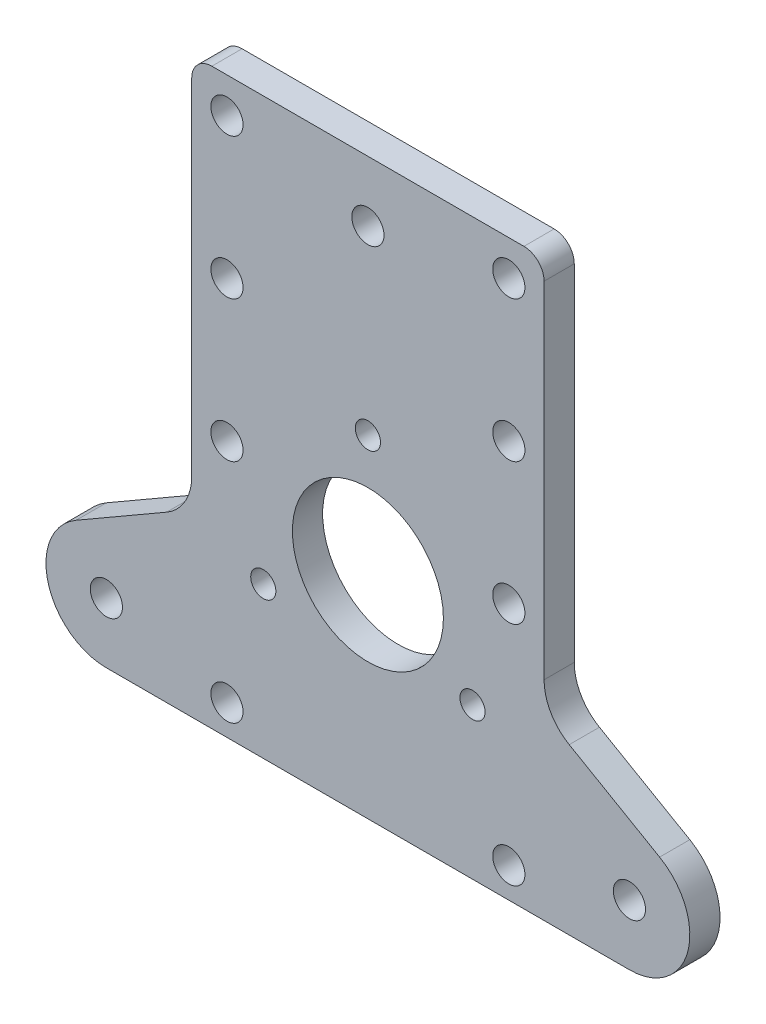
ISO-10303-21;
HEADER;
FILE_DESCRIPTION(('STEP AP214'),'2;1');
FILE_NAME('part.step','',(''),(''),'','','');
FILE_SCHEMA(('AUTOMOTIVE_DESIGN { 1 0 10303 214 1 1 1 1 }'));
ENDSEC;
DATA;
#1=APPLICATION_CONTEXT('core data for automotive mechanical design processes');
#2=APPLICATION_PROTOCOL_DEFINITION('international standard','automotive_design',2000,#1);
#3=PRODUCT_CONTEXT('',#1,'mechanical');
#4=PRODUCT('Part','Part','',(#3));
#5=PRODUCT_RELATED_PRODUCT_CATEGORY('part','',(#4));
#6=PRODUCT_DEFINITION_FORMATION('','',#4);
#7=PRODUCT_DEFINITION_CONTEXT('part definition',#1,'design');
#8=PRODUCT_DEFINITION('design','',#6,#7);
#9=PRODUCT_DEFINITION_SHAPE('','',#8);
#10=(LENGTH_UNIT() NAMED_UNIT(*) SI_UNIT(.MILLI.,.METRE.));
#11=(NAMED_UNIT(*) PLANE_ANGLE_UNIT() SI_UNIT($,.RADIAN.));
#12=(NAMED_UNIT(*) SI_UNIT($,.STERADIAN.) SOLID_ANGLE_UNIT());
#13=UNCERTAINTY_MEASURE_WITH_UNIT(LENGTH_MEASURE(1.E-05),#10,'distance_accuracy_value','');
#14=(GEOMETRIC_REPRESENTATION_CONTEXT(3) GLOBAL_UNCERTAINTY_ASSIGNED_CONTEXT((#13)) GLOBAL_UNIT_ASSIGNED_CONTEXT((#10,
#11,#12)) REPRESENTATION_CONTEXT('',''));
#15=CARTESIAN_POINT('',(0.,0.,0.));
#16=DIRECTION('',(0.,0.,1.));
#17=DIRECTION('',(1.,0.,0.));
#18=AXIS2_PLACEMENT_3D('',#15,#16,#17);
#19=CARTESIAN_POINT('',(25.9807621135331,-15.0000000000001,3.));
#20=DIRECTION('',(0.,0.,-1.));
#21=DIRECTION('',(-1.,0.,0.));
#22=AXIS2_PLACEMENT_3D('',#19,#20,#21);
#23=CYLINDRICAL_SURFACE('',#22,6.);
#24=CARTESIAN_POINT('',(25.9807621135331,-15.0000000000001,0.));
#25=DIRECTION('',(0.,0.,1.));
#26=DIRECTION('',(1.,0.,0.));
#27=AXIS2_PLACEMENT_3D('',#24,#25,#26);
#28=CIRCLE('',#27,6.);
#29=CARTESIAN_POINT('',(25.9807621135331,-21.0000000000001,0.));
#30=VERTEX_POINT('',#29);
#31=CARTESIAN_POINT('',(28.9807621135331,-9.80384757729348,0.));
#32=VERTEX_POINT('',#31);
#33=EDGE_CURVE('E167',#30,#32,#28,.T.);
#34=ORIENTED_EDGE('',*,*,#33,.T.);
#35=DIRECTION('',(0.,0.,-1.));
#36=VECTOR('',#35,1.);
#37=CARTESIAN_POINT('',(28.9807621135331,-9.80384757729348,3.));
#38=LINE('',#37,#36);
#39=CARTESIAN_POINT('',(28.9807621135331,-9.80384757729348,3.));
#40=VERTEX_POINT('',#39);
#41=EDGE_CURVE('E146',#40,#32,#38,.T.);
#42=ORIENTED_EDGE('',*,*,#41,.F.);
#43=CARTESIAN_POINT('',(25.9807621135331,-15.0000000000001,3.));
#44=DIRECTION('',(0.,0.,1.));
#45=DIRECTION('',(1.,0.,0.));
#46=AXIS2_PLACEMENT_3D('',#43,#44,#45);
#47=CIRCLE('',#46,6.);
#48=CARTESIAN_POINT('',(25.9807621135331,-21.0000000000001,3.));
#49=VERTEX_POINT('',#48);
#50=EDGE_CURVE('E154',#49,#40,#47,.T.);
#51=ORIENTED_EDGE('',*,*,#50,.F.);
#52=DIRECTION('',(0.,0.,-1.));
#53=VECTOR('',#52,1.);
#54=CARTESIAN_POINT('',(25.9807621135331,-21.0000000000001,3.));
#55=LINE('',#54,#53);
#56=EDGE_CURVE('E305',#49,#30,#55,.T.);
#57=ORIENTED_EDGE('',*,*,#56,.T.);
#58=EDGE_LOOP('',(#34,#42,#51,#57));
#59=FACE_BOUND('',#58,.T.);
#60=ADVANCED_FACE('F47',(#59),#23,.T.);
#61=CARTESIAN_POINT('',(28.9807621135331,-9.80384757729348,3.));
#62=DIRECTION('',(-0.5,-0.866025403784439,0.));
#63=DIRECTION('',(0.866025403784439,-0.5,0.));
#64=AXIS2_PLACEMENT_3D('',#61,#62,#63);
#65=PLANE('',#64);
#66=DIRECTION('',(-0.866025403784439,0.5,0.));
#67=VECTOR('',#66,1.);
#68=CARTESIAN_POINT('',(28.9807621135331,-9.80384757729348,0.));
#69=LINE('',#68,#67);
#70=CARTESIAN_POINT('',(20.,-4.61880215351718,0.));
#71=VERTEX_POINT('',#70);
#72=EDGE_CURVE('E316',#32,#71,#69,.T.);
#73=ORIENTED_EDGE('',*,*,#72,.T.);
#74=DIRECTION('',(0.,0.,-1.));
#75=VECTOR('',#74,1.);
#76=CARTESIAN_POINT('',(20.,-4.61880215351718,3.));
#77=LINE('',#76,#75);
#78=CARTESIAN_POINT('',(20.,-4.61880215351718,3.));
#79=VERTEX_POINT('',#78);
#80=EDGE_CURVE('E149',#71,#79,#77,.F.);
#81=ORIENTED_EDGE('',*,*,#80,.T.);
#82=DIRECTION('',(-0.866025403784439,0.5,0.));
#83=VECTOR('',#82,1.);
#84=CARTESIAN_POINT('',(28.9807621135331,-9.80384757729348,3.));
#85=LINE('',#84,#83);
#86=EDGE_CURVE('E141',#40,#79,#85,.T.);
#87=ORIENTED_EDGE('',*,*,#86,.F.);
#88=ORIENTED_EDGE('',*,*,#41,.T.);
#89=EDGE_LOOP('',(#73,#81,#87,#88));
#90=FACE_BOUND('',#89,.T.);
#91=ADVANCED_FACE('F144',(#90),#65,.F.);
#92=CARTESIAN_POINT('',(17.5,36.,3.));
#93=DIRECTION('',(-1.,0.,0.));
#94=DIRECTION('',(0.,-1.,0.));
#95=AXIS2_PLACEMENT_3D('',#92,#93,#94);
#96=PLANE('',#95);
#97=DIRECTION('',(0.,1.,0.));
#98=VECTOR('',#97,1.);
#99=CARTESIAN_POINT('',(17.5,36.,0.));
#100=LINE('',#99,#98);
#101=CARTESIAN_POINT('',(17.5,-0.28867513459499,0.));
#102=VERTEX_POINT('',#101);
#103=CARTESIAN_POINT('',(17.5,34.,0.));
#104=VERTEX_POINT('',#103);
#105=EDGE_CURVE('E297',#102,#104,#100,.T.);
#106=ORIENTED_EDGE('',*,*,#105,.T.);
#107=DIRECTION('',(0.,0.,-1.));
#108=VECTOR('',#107,1.);
#109=CARTESIAN_POINT('',(17.5,34.,3.));
#110=LINE('',#109,#108);
#111=CARTESIAN_POINT('',(17.5,34.,3.));
#112=VERTEX_POINT('',#111);
#113=EDGE_CURVE('E12',#104,#112,#110,.F.);
#114=ORIENTED_EDGE('',*,*,#113,.T.);
#115=DIRECTION('',(0.,1.,0.));
#116=VECTOR('',#115,1.);
#117=CARTESIAN_POINT('',(17.5,36.,3.));
#118=LINE('',#117,#116);
#119=CARTESIAN_POINT('',(17.5,-0.28867513459499,3.));
#120=VERTEX_POINT('',#119);
#121=EDGE_CURVE('E153',#120,#112,#118,.T.);
#122=ORIENTED_EDGE('',*,*,#121,.F.);
#123=DIRECTION('',(0.,0.,-1.));
#124=VECTOR('',#123,1.);
#125=CARTESIAN_POINT('',(17.5,-0.28867513459499,0.));
#126=LINE('',#125,#124);
#127=EDGE_CURVE('E169',#120,#102,#126,.T.);
#128=ORIENTED_EDGE('',*,*,#127,.T.);
#129=EDGE_LOOP('',(#106,#114,#122,#128));
#130=FACE_BOUND('',#129,.T.);
#131=ADVANCED_FACE('F324',(#130),#96,.F.);
#132=CARTESIAN_POINT('',(17.5,36.,3.));
#133=DIRECTION('',(0.,-1.,0.));
#134=DIRECTION('',(1.,0.,0.));
#135=AXIS2_PLACEMENT_3D('',#132,#133,#134);
#136=PLANE('',#135);
#137=DIRECTION('',(-1.,0.,0.));
#138=VECTOR('',#137,1.);
#139=CARTESIAN_POINT('',(17.5,36.,0.));
#140=LINE('',#139,#138);
#141=CARTESIAN_POINT('',(15.5,36.,0.));
#142=VERTEX_POINT('',#141);
#143=CARTESIAN_POINT('',(-15.5,36.,0.));
#144=VERTEX_POINT('',#143);
#145=EDGE_CURVE('E289',#142,#144,#140,.T.);
#146=ORIENTED_EDGE('',*,*,#145,.T.);
#147=DIRECTION('',(0.,0.,-1.));
#148=VECTOR('',#147,1.);
#149=CARTESIAN_POINT('',(-15.5,36.,3.));
#150=LINE('',#149,#148);
#151=CARTESIAN_POINT('',(-15.5,36.,3.));
#152=VERTEX_POINT('',#151);
#153=EDGE_CURVE('E71',#144,#152,#150,.F.);
#154=ORIENTED_EDGE('',*,*,#153,.T.);
#155=DIRECTION('',(-1.,0.,0.));
#156=VECTOR('',#155,1.);
#157=CARTESIAN_POINT('',(17.5,36.,3.));
#158=LINE('',#157,#156);
#159=CARTESIAN_POINT('',(15.5,36.,3.));
#160=VERTEX_POINT('',#159);
#161=EDGE_CURVE('E246',#160,#152,#158,.T.);
#162=ORIENTED_EDGE('',*,*,#161,.F.);
#163=DIRECTION('',(0.,0.,-1.));
#164=VECTOR('',#163,1.);
#165=CARTESIAN_POINT('',(15.5,36.,3.));
#166=LINE('',#165,#164);
#167=EDGE_CURVE('E221',#160,#142,#166,.T.);
#168=ORIENTED_EDGE('',*,*,#167,.T.);
#169=EDGE_LOOP('',(#146,#154,#162,#168));
#170=FACE_BOUND('',#169,.T.);
#171=ADVANCED_FACE('F327',(#170),#136,.F.);
#172=CARTESIAN_POINT('',(-17.5,36.,3.));
#173=DIRECTION('',(1.,0.,0.));
#174=DIRECTION('',(0.,1.,0.));
#175=AXIS2_PLACEMENT_3D('',#172,#173,#174);
#176=PLANE('',#175);
#177=DIRECTION('',(0.,-1.,0.));
#178=VECTOR('',#177,1.);
#179=CARTESIAN_POINT('',(-17.5,36.,3.));
#180=LINE('',#179,#178);
#181=CARTESIAN_POINT('',(-17.5,34.,3.));
#182=VERTEX_POINT('',#181);
#183=CARTESIAN_POINT('',(-17.5,-0.28867513459499,3.));
#184=VERTEX_POINT('',#183);
#185=EDGE_CURVE('E242',#182,#184,#180,.T.);
#186=ORIENTED_EDGE('',*,*,#185,.F.);
#187=DIRECTION('',(0.,0.,-1.));
#188=VECTOR('',#187,1.);
#189=CARTESIAN_POINT('',(-17.5,34.,3.));
#190=LINE('',#189,#188);
#191=CARTESIAN_POINT('',(-17.5,34.,0.));
#192=VERTEX_POINT('',#191);
#193=EDGE_CURVE('E211',#182,#192,#190,.T.);
#194=ORIENTED_EDGE('',*,*,#193,.T.);
#195=DIRECTION('',(0.,-1.,0.));
#196=VECTOR('',#195,1.);
#197=CARTESIAN_POINT('',(-17.5,36.,0.));
#198=LINE('',#197,#196);
#199=CARTESIAN_POINT('',(-17.5,-0.28867513459499,0.));
#200=VERTEX_POINT('',#199);
#201=EDGE_CURVE('E281',#192,#200,#198,.T.);
#202=ORIENTED_EDGE('',*,*,#201,.T.);
#203=DIRECTION('',(0.,0.,-1.));
#204=VECTOR('',#203,1.);
#205=CARTESIAN_POINT('',(-17.5,-0.28867513459499,3.));
#206=LINE('',#205,#204);
#207=EDGE_CURVE('E194',#200,#184,#206,.F.);
#208=ORIENTED_EDGE('',*,*,#207,.T.);
#209=EDGE_LOOP('',(#186,#194,#202,#208));
#210=FACE_BOUND('',#209,.T.);
#211=ADVANCED_FACE('F280',(#210),#176,.F.);
#212=CARTESIAN_POINT('',(-28.9807621135331,-9.8038475772935,3.));
#213=DIRECTION('',(0.5,-0.866025403784438,0.));
#214=DIRECTION('',(0.866025403784439,0.5,0.));
#215=AXIS2_PLACEMENT_3D('',#212,#213,#214);
#216=PLANE('',#215);
#217=DIRECTION('',(-0.866025403784439,-0.5,0.));
#218=VECTOR('',#217,1.);
#219=CARTESIAN_POINT('',(-28.9807621135331,-9.8038475772935,3.));
#220=LINE('',#219,#218);
#221=CARTESIAN_POINT('',(-20.,-4.61880215351718,3.));
#222=VERTEX_POINT('',#221);
#223=CARTESIAN_POINT('',(-28.9807621135331,-9.8038475772935,3.));
#224=VERTEX_POINT('',#223);
#225=EDGE_CURVE('E245',#222,#224,#220,.T.);
#226=ORIENTED_EDGE('',*,*,#225,.F.);
#227=DIRECTION('',(0.,0.,-1.));
#228=VECTOR('',#227,1.);
#229=CARTESIAN_POINT('',(-20.,-4.61880215351718,0.));
#230=LINE('',#229,#228);
#231=CARTESIAN_POINT('',(-20.,-4.61880215351718,0.));
#232=VERTEX_POINT('',#231);
#233=EDGE_CURVE('E190',#222,#232,#230,.T.);
#234=ORIENTED_EDGE('',*,*,#233,.T.);
#235=DIRECTION('',(-0.866025403784439,-0.5,0.));
#236=VECTOR('',#235,1.);
#237=CARTESIAN_POINT('',(-28.9807621135331,-9.8038475772935,0.));
#238=LINE('',#237,#236);
#239=CARTESIAN_POINT('',(-28.9807621135331,-9.8038475772935,0.));
#240=VERTEX_POINT('',#239);
#241=EDGE_CURVE('E288',#232,#240,#238,.T.);
#242=ORIENTED_EDGE('',*,*,#241,.T.);
#243=DIRECTION('',(0.,0.,-1.));
#244=VECTOR('',#243,1.);
#245=CARTESIAN_POINT('',(-28.9807621135331,-9.8038475772935,3.));
#246=LINE('',#245,#244);
#247=EDGE_CURVE('E170',#224,#240,#246,.T.);
#248=ORIENTED_EDGE('',*,*,#247,.F.);
#249=EDGE_LOOP('',(#226,#234,#242,#248));
#250=FACE_BOUND('',#249,.T.);
#251=ADVANCED_FACE('F334',(#250),#216,.F.);
#252=CARTESIAN_POINT('',(-25.9807621135331,-15.0000000000001,3.));
#253=DIRECTION('',(0.,0.,-1.));
#254=DIRECTION('',(-1.,0.,0.));
#255=AXIS2_PLACEMENT_3D('',#252,#253,#254);
#256=CYLINDRICAL_SURFACE('',#255,6.);
#257=CARTESIAN_POINT('',(-25.9807621135331,-15.0000000000001,0.));
#258=DIRECTION('',(0.,0.,1.));
#259=DIRECTION('',(1.,0.,0.));
#260=AXIS2_PLACEMENT_3D('',#257,#258,#259);
#261=CIRCLE('',#260,6.);
#262=CARTESIAN_POINT('',(-25.9807621135331,-21.0000000000001,0.));
#263=VERTEX_POINT('',#262);
#264=EDGE_CURVE('E294',#240,#263,#261,.T.);
#265=ORIENTED_EDGE('',*,*,#264,.T.);
#266=DIRECTION('',(0.,0.,-1.));
#267=VECTOR('',#266,1.);
#268=CARTESIAN_POINT('',(-25.9807621135331,-21.0000000000001,3.));
#269=LINE('',#268,#267);
#270=CARTESIAN_POINT('',(-25.9807621135331,-21.0000000000001,3.));
#271=VERTEX_POINT('',#270);
#272=EDGE_CURVE('E179',#271,#263,#269,.T.);
#273=ORIENTED_EDGE('',*,*,#272,.F.);
#274=CARTESIAN_POINT('',(-25.9807621135331,-15.0000000000001,3.));
#275=DIRECTION('',(0.,0.,1.));
#276=DIRECTION('',(1.,0.,0.));
#277=AXIS2_PLACEMENT_3D('',#274,#275,#276);
#278=CIRCLE('',#277,6.);
#279=EDGE_CURVE('E252',#224,#271,#278,.T.);
#280=ORIENTED_EDGE('',*,*,#279,.F.);
#281=ORIENTED_EDGE('',*,*,#247,.T.);
#282=EDGE_LOOP('',(#265,#273,#280,#281));
#283=FACE_BOUND('',#282,.T.);
#284=ADVANCED_FACE('F396',(#283),#256,.T.);
#285=CARTESIAN_POINT('',(25.9807621135331,-21.0000000000001,3.));
#286=DIRECTION('',(0.,1.,0.));
#287=DIRECTION('',(0.,0.,1.));
#288=AXIS2_PLACEMENT_3D('',#285,#286,#287);
#289=PLANE('',#288);
#290=DIRECTION('',(1.,0.,0.));
#291=VECTOR('',#290,1.);
#292=CARTESIAN_POINT('',(25.9807621135331,-21.0000000000001,0.));
#293=LINE('',#292,#291);
#294=EDGE_CURVE('E164',#263,#30,#293,.T.);
#295=ORIENTED_EDGE('',*,*,#294,.T.);
#296=ORIENTED_EDGE('',*,*,#56,.F.);
#297=DIRECTION('',(1.,0.,0.));
#298=VECTOR('',#297,1.);
#299=CARTESIAN_POINT('',(25.9807621135331,-21.0000000000001,3.));
#300=LINE('',#299,#298);
#301=EDGE_CURVE('E159',#271,#49,#300,.T.);
#302=ORIENTED_EDGE('',*,*,#301,.F.);
#303=ORIENTED_EDGE('',*,*,#272,.T.);
#304=EDGE_LOOP('',(#295,#296,#302,#303));
#305=FACE_BOUND('',#304,.T.);
#306=ADVANCED_FACE('F312',(#305),#289,.F.);
#307=CARTESIAN_POINT('',(25.9807621135331,-15.0000000000001,3.));
#308=DIRECTION('',(0.,0.,1.));
#309=DIRECTION('',(1.,0.,0.));
#310=AXIS2_PLACEMENT_3D('',#307,#308,#309);
#311=PLANE('',#310);
#312=CARTESIAN_POINT('',(0.,30.,3.));
#313=DIRECTION('',(0.,0.,1.));
#314=DIRECTION('',(1.,0.,0.));
#315=AXIS2_PLACEMENT_3D('',#312,#313,#314);
#316=CIRCLE('',#315,1.59999999999999);
#317=CARTESIAN_POINT('',(1.59999999999999,30.,3.));
#318=VERTEX_POINT('',#317);
#319=EDGE_CURVE('E687',#318,#318,#316,.T.);
#320=ORIENTED_EDGE('',*,*,#319,.F.);
#321=EDGE_LOOP('',(#320));
#322=FACE_BOUND('',#321,.T.);
#323=CARTESIAN_POINT('',(25.9807621135331,-15.0000000000001,3.));
#324=DIRECTION('',(0.,0.,1.));
#325=DIRECTION('',(1.,0.,0.));
#326=AXIS2_PLACEMENT_3D('',#323,#324,#325);
#327=CIRCLE('',#326,1.59999999999999);
#328=CARTESIAN_POINT('',(27.5807621135331,-15.0000000000001,3.));
#329=VERTEX_POINT('',#328);
#330=EDGE_CURVE('E691',#329,#329,#327,.T.);
#331=ORIENTED_EDGE('',*,*,#330,.F.);
#332=EDGE_LOOP('',(#331));
#333=FACE_BOUND('',#332,.T.);
#334=CARTESIAN_POINT('',(-25.9807621135331,-15.0000000000001,3.));
#335=DIRECTION('',(0.,0.,1.));
#336=DIRECTION('',(1.,0.,0.));
#337=AXIS2_PLACEMENT_3D('',#334,#335,#336);
#338=CIRCLE('',#337,1.59999999999999);
#339=CARTESIAN_POINT('',(-24.3807621135331,-15.0000000000001,3.));
#340=VERTEX_POINT('',#339);
#341=EDGE_CURVE('E707',#340,#340,#338,.T.);
#342=ORIENTED_EDGE('',*,*,#341,.F.);
#343=EDGE_LOOP('',(#342));
#344=FACE_BOUND('',#343,.T.);
#345=CARTESIAN_POINT('',(14.,32.5,3.));
#346=DIRECTION('',(0.,0.,1.));
#347=DIRECTION('',(1.,0.,0.));
#348=AXIS2_PLACEMENT_3D('',#345,#346,#347);
#349=CIRCLE('',#348,1.6);
#350=CARTESIAN_POINT('',(15.6,32.5,3.));
#351=VERTEX_POINT('',#350);
#352=EDGE_CURVE('E711',#351,#351,#349,.T.);
#353=ORIENTED_EDGE('',*,*,#352,.F.);
#354=EDGE_LOOP('',(#353));
#355=FACE_BOUND('',#354,.T.);
#356=CARTESIAN_POINT('',(14.,18.5,3.));
#357=DIRECTION('',(0.,0.,1.));
#358=DIRECTION('',(1.,0.,0.));
#359=AXIS2_PLACEMENT_3D('',#356,#357,#358);
#360=CIRCLE('',#359,1.6);
#361=CARTESIAN_POINT('',(15.6,18.5,3.));
#362=VERTEX_POINT('',#361);
#363=EDGE_CURVE('E720',#362,#362,#360,.T.);
#364=ORIENTED_EDGE('',*,*,#363,.F.);
#365=EDGE_LOOP('',(#364));
#366=FACE_BOUND('',#365,.T.);
#367=CARTESIAN_POINT('',(14.,4.49999999999999,3.));
#368=DIRECTION('',(0.,0.,1.));
#369=DIRECTION('',(1.,0.,0.));
#370=AXIS2_PLACEMENT_3D('',#367,#368,#369);
#371=CIRCLE('',#370,1.6);
#372=CARTESIAN_POINT('',(15.6,4.49999999999999,3.));
#373=VERTEX_POINT('',#372);
#374=EDGE_CURVE('E725',#373,#373,#371,.T.);
#375=ORIENTED_EDGE('',*,*,#374,.F.);
#376=EDGE_LOOP('',(#375));
#377=FACE_BOUND('',#376,.T.);
#378=CARTESIAN_POINT('',(14.,-18.0000000000001,3.));
#379=DIRECTION('',(0.,0.,1.));
#380=DIRECTION('',(1.,0.,0.));
#381=AXIS2_PLACEMENT_3D('',#378,#379,#380);
#382=CIRCLE('',#381,1.6);
#383=CARTESIAN_POINT('',(15.6,-18.0000000000001,3.));
#384=VERTEX_POINT('',#383);
#385=EDGE_CURVE('E733',#384,#384,#382,.T.);
#386=ORIENTED_EDGE('',*,*,#385,.F.);
#387=EDGE_LOOP('',(#386));
#388=FACE_BOUND('',#387,.T.);
#389=CARTESIAN_POINT('',(-14.,-18.0000000000001,3.));
#390=DIRECTION('',(0.,0.,1.));
#391=DIRECTION('',(1.,0.,0.));
#392=AXIS2_PLACEMENT_3D('',#389,#390,#391);
#393=CIRCLE('',#392,1.6);
#394=CARTESIAN_POINT('',(-12.4,-18.0000000000001,3.));
#395=VERTEX_POINT('',#394);
#396=EDGE_CURVE('E742',#395,#395,#393,.T.);
#397=ORIENTED_EDGE('',*,*,#396,.F.);
#398=EDGE_LOOP('',(#397));
#399=FACE_BOUND('',#398,.T.);
#400=CARTESIAN_POINT('',(-14.,4.49999999999999,3.));
#401=DIRECTION('',(0.,0.,1.));
#402=DIRECTION('',(1.,0.,0.));
#403=AXIS2_PLACEMENT_3D('',#400,#401,#402);
#404=CIRCLE('',#403,1.6);
#405=CARTESIAN_POINT('',(-12.4,4.49999999999999,3.));
#406=VERTEX_POINT('',#405);
#407=EDGE_CURVE('E750',#406,#406,#404,.T.);
#408=ORIENTED_EDGE('',*,*,#407,.F.);
#409=EDGE_LOOP('',(#408));
#410=FACE_BOUND('',#409,.T.);
#411=CARTESIAN_POINT('',(-14.,18.5,3.));
#412=DIRECTION('',(0.,0.,1.));
#413=DIRECTION('',(1.,0.,0.));
#414=AXIS2_PLACEMENT_3D('',#411,#412,#413);
#415=CIRCLE('',#414,1.6);
#416=CARTESIAN_POINT('',(-12.4,18.5,3.));
#417=VERTEX_POINT('',#416);
#418=EDGE_CURVE('E760',#417,#417,#415,.T.);
#419=ORIENTED_EDGE('',*,*,#418,.F.);
#420=EDGE_LOOP('',(#419));
#421=FACE_BOUND('',#420,.T.);
#422=CARTESIAN_POINT('',(-14.,32.5,3.));
#423=DIRECTION('',(0.,0.,1.));
#424=DIRECTION('',(1.,0.,0.));
#425=AXIS2_PLACEMENT_3D('',#422,#423,#424);
#426=CIRCLE('',#425,1.6);
#427=CARTESIAN_POINT('',(-12.4,32.5,3.));
#428=VERTEX_POINT('',#427);
#429=EDGE_CURVE('E767',#428,#428,#426,.T.);
#430=ORIENTED_EDGE('',*,*,#429,.F.);
#431=EDGE_LOOP('',(#430));
#432=FACE_BOUND('',#431,.T.);
#433=CARTESIAN_POINT('',(-10.3923048454132,-6.00000000000005,3.));
#434=DIRECTION('',(0.,0.,-1.));
#435=DIRECTION('',(-1.,0.,0.));
#436=AXIS2_PLACEMENT_3D('',#433,#434,#435);
#437=CIRCLE('',#436,1.25);
#438=CARTESIAN_POINT('',(-11.6423048454132,-6.00000000000005,3.));
#439=VERTEX_POINT('',#438);
#440=EDGE_CURVE('E779',#439,#439,#437,.T.);
#441=ORIENTED_EDGE('',*,*,#440,.T.);
#442=EDGE_LOOP('',(#441));
#443=FACE_BOUND('',#442,.T.);
#444=CARTESIAN_POINT('',(0.,12.,3.));
#445=DIRECTION('',(0.,0.,-1.));
#446=DIRECTION('',(-1.,0.,0.));
#447=AXIS2_PLACEMENT_3D('',#444,#445,#446);
#448=CIRCLE('',#447,1.25);
#449=CARTESIAN_POINT('',(-1.25,12.,3.));
#450=VERTEX_POINT('',#449);
#451=EDGE_CURVE('E788',#450,#450,#448,.T.);
#452=ORIENTED_EDGE('',*,*,#451,.T.);
#453=EDGE_LOOP('',(#452));
#454=FACE_BOUND('',#453,.T.);
#455=CARTESIAN_POINT('',(10.3923048454132,-6.00000000000005,3.));
#456=DIRECTION('',(0.,0.,-1.));
#457=DIRECTION('',(-1.,0.,0.));
#458=AXIS2_PLACEMENT_3D('',#455,#456,#457);
#459=CIRCLE('',#458,1.25);
#460=CARTESIAN_POINT('',(9.14230484541323,-6.00000000000005,3.));
#461=VERTEX_POINT('',#460);
#462=EDGE_CURVE('E795',#461,#461,#459,.T.);
#463=ORIENTED_EDGE('',*,*,#462,.T.);
#464=EDGE_LOOP('',(#463));
#465=FACE_BOUND('',#464,.T.);
#466=CARTESIAN_POINT('',(0.,0.,3.));
#467=DIRECTION('',(0.,0.,1.));
#468=DIRECTION('',(1.,0.,0.));
#469=AXIS2_PLACEMENT_3D('',#466,#467,#468);
#470=CIRCLE('',#469,7.5);
#471=CARTESIAN_POINT('',(7.5,0.,3.));
#472=VERTEX_POINT('',#471);
#473=EDGE_CURVE('E186',#472,#472,#470,.T.);
#474=ORIENTED_EDGE('',*,*,#473,.F.);
#475=EDGE_LOOP('',(#474));
#476=FACE_BOUND('',#475,.T.);
#477=ORIENTED_EDGE('',*,*,#161,.T.);
#478=CARTESIAN_POINT('',(-15.5,34.,3.));
#479=DIRECTION('',(0.,0.,1.));
#480=DIRECTION('',(1.,0.,0.));
#481=AXIS2_PLACEMENT_3D('',#478,#479,#480);
#482=CIRCLE('',#481,2.);
#483=EDGE_CURVE('E57',#152,#182,#482,.T.);
#484=ORIENTED_EDGE('',*,*,#483,.T.);
#485=ORIENTED_EDGE('',*,*,#185,.T.);
#486=CARTESIAN_POINT('',(-22.5,-0.28867513459499,3.));
#487=DIRECTION('',(0.,0.,1.));
#488=DIRECTION('',(1.,0.,0.));
#489=AXIS2_PLACEMENT_3D('',#486,#487,#488);
#490=CIRCLE('',#489,5.);
#491=EDGE_CURVE('E208',#184,#222,#490,.F.);
#492=ORIENTED_EDGE('',*,*,#491,.T.);
#493=ORIENTED_EDGE('',*,*,#225,.T.);
#494=ORIENTED_EDGE('',*,*,#279,.T.);
#495=ORIENTED_EDGE('',*,*,#301,.T.);
#496=ORIENTED_EDGE('',*,*,#50,.T.);
#497=ORIENTED_EDGE('',*,*,#86,.T.);
#498=CARTESIAN_POINT('',(22.5,-0.28867513459499,3.));
#499=DIRECTION('',(0.,0.,1.));
#500=DIRECTION('',(1.,0.,0.));
#501=AXIS2_PLACEMENT_3D('',#498,#499,#500);
#502=CIRCLE('',#501,5.);
#503=EDGE_CURVE('E201',#79,#120,#502,.F.);
#504=ORIENTED_EDGE('',*,*,#503,.T.);
#505=ORIENTED_EDGE('',*,*,#121,.T.);
#506=CARTESIAN_POINT('',(15.5,34.,3.));
#507=DIRECTION('',(0.,0.,1.));
#508=DIRECTION('',(1.,0.,0.));
#509=AXIS2_PLACEMENT_3D('',#506,#507,#508);
#510=CIRCLE('',#509,2.);
#511=EDGE_CURVE('E226',#112,#160,#510,.T.);
#512=ORIENTED_EDGE('',*,*,#511,.T.);
#513=EDGE_LOOP('',(#477,#484,#485,#492,#493,#494,#495,#496,#497,#504,#505,#512));
#514=FACE_BOUND('',#513,.T.);
#515=ADVANCED_FACE('F157',(#322,#333,#344,#355,#366,#377,#388,#399,#410,#421,#432,#443,#454,
#465,#476,#514),#311,.T.);
#516=CARTESIAN_POINT('',(25.9807621135331,-15.0000000000001,0.));
#517=DIRECTION('',(0.,0.,1.));
#518=DIRECTION('',(1.,0.,0.));
#519=AXIS2_PLACEMENT_3D('',#516,#517,#518);
#520=PLANE('',#519);
#521=CARTESIAN_POINT('',(0.,30.,0.));
#522=DIRECTION('',(0.,0.,1.));
#523=DIRECTION('',(1.,0.,0.));
#524=AXIS2_PLACEMENT_3D('',#521,#522,#523);
#525=CIRCLE('',#524,1.59999999999999);
#526=CARTESIAN_POINT('',(1.59999999999999,30.,0.));
#527=VERTEX_POINT('',#526);
#528=EDGE_CURVE('E51',#527,#527,#525,.T.);
#529=ORIENTED_EDGE('',*,*,#528,.T.);
#530=EDGE_LOOP('',(#529));
#531=FACE_BOUND('',#530,.T.);
#532=CARTESIAN_POINT('',(25.9807621135331,-15.0000000000001,0.));
#533=DIRECTION('',(0.,0.,1.));
#534=DIRECTION('',(1.,0.,0.));
#535=AXIS2_PLACEMENT_3D('',#532,#533,#534);
#536=CIRCLE('',#535,1.59999999999999);
#537=CARTESIAN_POINT('',(27.5807621135331,-15.0000000000001,0.));
#538=VERTEX_POINT('',#537);
#539=EDGE_CURVE('E695',#538,#538,#536,.T.);
#540=ORIENTED_EDGE('',*,*,#539,.T.);
#541=EDGE_LOOP('',(#540));
#542=FACE_BOUND('',#541,.T.);
#543=CARTESIAN_POINT('',(-25.9807621135331,-15.0000000000001,0.));
#544=DIRECTION('',(0.,0.,1.));
#545=DIRECTION('',(1.,0.,0.));
#546=AXIS2_PLACEMENT_3D('',#543,#544,#545);
#547=CIRCLE('',#546,1.59999999999999);
#548=CARTESIAN_POINT('',(-24.3807621135331,-15.0000000000001,0.));
#549=VERTEX_POINT('',#548);
#550=EDGE_CURVE('E710',#549,#549,#547,.T.);
#551=ORIENTED_EDGE('',*,*,#550,.T.);
#552=EDGE_LOOP('',(#551));
#553=FACE_BOUND('',#552,.T.);
#554=CARTESIAN_POINT('',(14.,32.5,0.));
#555=DIRECTION('',(0.,0.,1.));
#556=DIRECTION('',(1.,0.,0.));
#557=AXIS2_PLACEMENT_3D('',#554,#555,#556);
#558=CIRCLE('',#557,1.6);
#559=CARTESIAN_POINT('',(15.6,32.5,0.));
#560=VERTEX_POINT('',#559);
#561=EDGE_CURVE('E716',#560,#560,#558,.T.);
#562=ORIENTED_EDGE('',*,*,#561,.T.);
#563=EDGE_LOOP('',(#562));
#564=FACE_BOUND('',#563,.T.);
#565=CARTESIAN_POINT('',(14.,18.5,0.));
#566=DIRECTION('',(0.,0.,1.));
#567=DIRECTION('',(1.,0.,0.));
#568=AXIS2_PLACEMENT_3D('',#565,#566,#567);
#569=CIRCLE('',#568,1.6);
#570=CARTESIAN_POINT('',(15.6,18.5,0.));
#571=VERTEX_POINT('',#570);
#572=EDGE_CURVE('E724',#571,#571,#569,.T.);
#573=ORIENTED_EDGE('',*,*,#572,.T.);
#574=EDGE_LOOP('',(#573));
#575=FACE_BOUND('',#574,.T.);
#576=CARTESIAN_POINT('',(14.,4.49999999999999,0.));
#577=DIRECTION('',(0.,0.,1.));
#578=DIRECTION('',(1.,0.,0.));
#579=AXIS2_PLACEMENT_3D('',#576,#577,#578);
#580=CIRCLE('',#579,1.6);
#581=CARTESIAN_POINT('',(15.6,4.49999999999999,0.));
#582=VERTEX_POINT('',#581);
#583=EDGE_CURVE('E739',#582,#582,#580,.T.);
#584=ORIENTED_EDGE('',*,*,#583,.T.);
#585=EDGE_LOOP('',(#584));
#586=FACE_BOUND('',#585,.T.);
#587=CARTESIAN_POINT('',(14.,-18.0000000000001,0.));
#588=DIRECTION('',(0.,0.,1.));
#589=DIRECTION('',(1.,0.,0.));
#590=AXIS2_PLACEMENT_3D('',#587,#588,#589);
#591=CIRCLE('',#590,1.6);
#592=CARTESIAN_POINT('',(15.6,-18.0000000000001,0.));
#593=VERTEX_POINT('',#592);
#594=EDGE_CURVE('E738',#593,#593,#591,.T.);
#595=ORIENTED_EDGE('',*,*,#594,.T.);
#596=EDGE_LOOP('',(#595));
#597=FACE_BOUND('',#596,.T.);
#598=CARTESIAN_POINT('',(-14.,-18.0000000000001,0.));
#599=DIRECTION('',(0.,0.,1.));
#600=DIRECTION('',(1.,0.,0.));
#601=AXIS2_PLACEMENT_3D('',#598,#599,#600);
#602=CIRCLE('',#601,1.6);
#603=CARTESIAN_POINT('',(-12.4,-18.0000000000001,0.));
#604=VERTEX_POINT('',#603);
#605=EDGE_CURVE('E747',#604,#604,#602,.T.);
#606=ORIENTED_EDGE('',*,*,#605,.T.);
#607=EDGE_LOOP('',(#606));
#608=FACE_BOUND('',#607,.T.);
#609=CARTESIAN_POINT('',(-14.,4.49999999999999,0.));
#610=DIRECTION('',(0.,0.,1.));
#611=DIRECTION('',(1.,0.,0.));
#612=AXIS2_PLACEMENT_3D('',#609,#610,#611);
#613=CIRCLE('',#612,1.6);
#614=CARTESIAN_POINT('',(-12.4,4.49999999999999,0.));
#615=VERTEX_POINT('',#614);
#616=EDGE_CURVE('E754',#615,#615,#613,.T.);
#617=ORIENTED_EDGE('',*,*,#616,.T.);
#618=EDGE_LOOP('',(#617));
#619=FACE_BOUND('',#618,.T.);
#620=CARTESIAN_POINT('',(-14.,18.5,0.));
#621=DIRECTION('',(0.,0.,1.));
#622=DIRECTION('',(1.,0.,0.));
#623=AXIS2_PLACEMENT_3D('',#620,#621,#622);
#624=CIRCLE('',#623,1.6);
#625=CARTESIAN_POINT('',(-12.4,18.5,0.));
#626=VERTEX_POINT('',#625);
#627=EDGE_CURVE('E765',#626,#626,#624,.T.);
#628=ORIENTED_EDGE('',*,*,#627,.T.);
#629=EDGE_LOOP('',(#628));
#630=FACE_BOUND('',#629,.T.);
#631=CARTESIAN_POINT('',(-14.,32.5,0.));
#632=DIRECTION('',(0.,0.,1.));
#633=DIRECTION('',(1.,0.,0.));
#634=AXIS2_PLACEMENT_3D('',#631,#632,#633);
#635=CIRCLE('',#634,1.6);
#636=CARTESIAN_POINT('',(-12.4,32.5,0.));
#637=VERTEX_POINT('',#636);
#638=EDGE_CURVE('E771',#637,#637,#635,.T.);
#639=ORIENTED_EDGE('',*,*,#638,.T.);
#640=EDGE_LOOP('',(#639));
#641=FACE_BOUND('',#640,.T.);
#642=CARTESIAN_POINT('',(-10.3923048454132,-6.00000000000005,0.));
#643=DIRECTION('',(0.,0.,-1.));
#644=DIRECTION('',(-1.,0.,0.));
#645=AXIS2_PLACEMENT_3D('',#642,#643,#644);
#646=CIRCLE('',#645,1.25);
#647=CARTESIAN_POINT('',(-11.6423048454132,-6.00000000000005,0.));
#648=VERTEX_POINT('',#647);
#649=EDGE_CURVE('E775',#648,#648,#646,.T.);
#650=ORIENTED_EDGE('',*,*,#649,.F.);
#651=EDGE_LOOP('',(#650));
#652=FACE_BOUND('',#651,.T.);
#653=CARTESIAN_POINT('',(0.,12.,0.));
#654=DIRECTION('',(0.,0.,-1.));
#655=DIRECTION('',(-1.,0.,0.));
#656=AXIS2_PLACEMENT_3D('',#653,#654,#655);
#657=CIRCLE('',#656,1.25);
#658=CARTESIAN_POINT('',(-1.25,12.,0.));
#659=VERTEX_POINT('',#658);
#660=EDGE_CURVE('E784',#659,#659,#657,.T.);
#661=ORIENTED_EDGE('',*,*,#660,.F.);
#662=EDGE_LOOP('',(#661));
#663=FACE_BOUND('',#662,.T.);
#664=CARTESIAN_POINT('',(10.3923048454132,-6.00000000000005,0.));
#665=DIRECTION('',(0.,0.,-1.));
#666=DIRECTION('',(-1.,0.,0.));
#667=AXIS2_PLACEMENT_3D('',#664,#665,#666);
#668=CIRCLE('',#667,1.25);
#669=CARTESIAN_POINT('',(9.14230484541323,-6.00000000000005,0.));
#670=VERTEX_POINT('',#669);
#671=EDGE_CURVE('E793',#670,#670,#668,.T.);
#672=ORIENTED_EDGE('',*,*,#671,.F.);
#673=EDGE_LOOP('',(#672));
#674=FACE_BOUND('',#673,.T.);
#675=CARTESIAN_POINT('',(0.,0.,0.));
#676=DIRECTION('',(0.,0.,1.));
#677=DIRECTION('',(1.,0.,0.));
#678=AXIS2_PLACEMENT_3D('',#675,#676,#677);
#679=CIRCLE('',#678,7.5);
#680=CARTESIAN_POINT('',(7.5,0.,0.));
#681=VERTEX_POINT('',#680);
#682=EDGE_CURVE('E183',#681,#681,#679,.T.);
#683=ORIENTED_EDGE('',*,*,#682,.T.);
#684=EDGE_LOOP('',(#683));
#685=FACE_BOUND('',#684,.T.);
#686=ORIENTED_EDGE('',*,*,#201,.F.);
#687=CARTESIAN_POINT('',(-15.5,34.,0.));
#688=DIRECTION('',(0.,0.,1.));
#689=DIRECTION('',(1.,0.,0.));
#690=AXIS2_PLACEMENT_3D('',#687,#688,#689);
#691=CIRCLE('',#690,2.);
#692=EDGE_CURVE('E218',#192,#144,#691,.F.);
#693=ORIENTED_EDGE('',*,*,#692,.T.);
#694=ORIENTED_EDGE('',*,*,#145,.F.);
#695=CARTESIAN_POINT('',(15.5,34.,0.));
#696=DIRECTION('',(0.,0.,1.));
#697=DIRECTION('',(1.,0.,0.));
#698=AXIS2_PLACEMENT_3D('',#695,#696,#697);
#699=CIRCLE('',#698,2.);
#700=EDGE_CURVE('E215',#142,#104,#699,.F.);
#701=ORIENTED_EDGE('',*,*,#700,.T.);
#702=ORIENTED_EDGE('',*,*,#105,.F.);
#703=CARTESIAN_POINT('',(22.5,-0.28867513459499,0.));
#704=DIRECTION('',(0.,0.,1.));
#705=DIRECTION('',(1.,0.,0.));
#706=AXIS2_PLACEMENT_3D('',#703,#704,#705);
#707=CIRCLE('',#706,5.);
#708=EDGE_CURVE('E198',#102,#71,#707,.T.);
#709=ORIENTED_EDGE('',*,*,#708,.T.);
#710=ORIENTED_EDGE('',*,*,#72,.F.);
#711=ORIENTED_EDGE('',*,*,#33,.F.);
#712=ORIENTED_EDGE('',*,*,#294,.F.);
#713=ORIENTED_EDGE('',*,*,#264,.F.);
#714=ORIENTED_EDGE('',*,*,#241,.F.);
#715=CARTESIAN_POINT('',(-22.5,-0.28867513459499,0.));
#716=DIRECTION('',(0.,0.,1.));
#717=DIRECTION('',(1.,0.,0.));
#718=AXIS2_PLACEMENT_3D('',#715,#716,#717);
#719=CIRCLE('',#718,5.);
#720=EDGE_CURVE('E204',#232,#200,#719,.T.);
#721=ORIENTED_EDGE('',*,*,#720,.T.);
#722=EDGE_LOOP('',(#686,#693,#694,#701,#702,#709,#710,#711,#712,#713,#714,#721));
#723=FACE_BOUND('',#722,.T.);
#724=ADVANCED_FACE('F283',(#531,#542,#553,#564,#575,#586,#597,#608,#619,#630,#641,#652,#663,
#674,#685,#723),#520,.F.);
#725=CARTESIAN_POINT('',(0.,0.,-3.59999999999999));
#726=DIRECTION('',(0.,0.,1.));
#727=DIRECTION('',(1.,0.,0.));
#728=AXIS2_PLACEMENT_3D('',#725,#726,#727);
#729=CYLINDRICAL_SURFACE('',#728,7.5);
#730=ORIENTED_EDGE('',*,*,#473,.T.);
#731=EDGE_LOOP('',(#730));
#732=FACE_BOUND('',#731,.T.);
#733=ORIENTED_EDGE('',*,*,#682,.F.);
#734=EDGE_LOOP('',(#733));
#735=FACE_BOUND('',#734,.T.);
#736=ADVANCED_FACE('F383',(#732,#735),#729,.F.);
#737=CARTESIAN_POINT('',(10.3923048454132,-6.00000000000005,0.));
#738=DIRECTION('',(0.,0.,-1.));
#739=DIRECTION('',(-1.,0.,0.));
#740=AXIS2_PLACEMENT_3D('',#737,#738,#739);
#741=CYLINDRICAL_SURFACE('',#740,1.25);
#742=ORIENTED_EDGE('',*,*,#462,.F.);
#743=EDGE_LOOP('',(#742));
#744=FACE_BOUND('',#743,.T.);
#745=ORIENTED_EDGE('',*,*,#671,.T.);
#746=EDGE_LOOP('',(#745));
#747=FACE_BOUND('',#746,.T.);
#748=ADVANCED_FACE('F379',(#744,#747),#741,.F.);
#749=CARTESIAN_POINT('',(0.,12.,0.));
#750=DIRECTION('',(0.,0.,-1.));
#751=DIRECTION('',(-1.,0.,0.));
#752=AXIS2_PLACEMENT_3D('',#749,#750,#751);
#753=CYLINDRICAL_SURFACE('',#752,1.25);
#754=ORIENTED_EDGE('',*,*,#451,.F.);
#755=EDGE_LOOP('',(#754));
#756=FACE_BOUND('',#755,.T.);
#757=ORIENTED_EDGE('',*,*,#660,.T.);
#758=EDGE_LOOP('',(#757));
#759=FACE_BOUND('',#758,.T.);
#760=ADVANCED_FACE('F375',(#756,#759),#753,.F.);
#761=CARTESIAN_POINT('',(-10.3923048454132,-6.00000000000005,0.));
#762=DIRECTION('',(0.,0.,-1.));
#763=DIRECTION('',(-1.,0.,0.));
#764=AXIS2_PLACEMENT_3D('',#761,#762,#763);
#765=CYLINDRICAL_SURFACE('',#764,1.25);
#766=ORIENTED_EDGE('',*,*,#440,.F.);
#767=EDGE_LOOP('',(#766));
#768=FACE_BOUND('',#767,.T.);
#769=ORIENTED_EDGE('',*,*,#649,.T.);
#770=EDGE_LOOP('',(#769));
#771=FACE_BOUND('',#770,.T.);
#772=ADVANCED_FACE('F348',(#768,#771),#765,.F.);
#773=CARTESIAN_POINT('',(22.5,-0.28867513459499,3.));
#774=DIRECTION('',(0.,0.,1.));
#775=DIRECTION('',(1.,0.,0.));
#776=AXIS2_PLACEMENT_3D('',#773,#774,#775);
#777=CYLINDRICAL_SURFACE('',#776,5.);
#778=ORIENTED_EDGE('',*,*,#503,.F.);
#779=ORIENTED_EDGE('',*,*,#80,.F.);
#780=ORIENTED_EDGE('',*,*,#708,.F.);
#781=ORIENTED_EDGE('',*,*,#127,.F.);
#782=EDGE_LOOP('',(#778,#779,#780,#781));
#783=FACE_BOUND('',#782,.T.);
#784=ADVANCED_FACE('F344',(#783),#777,.F.);
#785=CARTESIAN_POINT('',(-22.5,-0.28867513459499,3.));
#786=DIRECTION('',(0.,0.,1.));
#787=DIRECTION('',(1.,0.,0.));
#788=AXIS2_PLACEMENT_3D('',#785,#786,#787);
#789=CYLINDRICAL_SURFACE('',#788,5.);
#790=ORIENTED_EDGE('',*,*,#491,.F.);
#791=ORIENTED_EDGE('',*,*,#207,.F.);
#792=ORIENTED_EDGE('',*,*,#720,.F.);
#793=ORIENTED_EDGE('',*,*,#233,.F.);
#794=EDGE_LOOP('',(#790,#791,#792,#793));
#795=FACE_BOUND('',#794,.T.);
#796=ADVANCED_FACE('F347',(#795),#789,.F.);
#797=CARTESIAN_POINT('',(-15.5,34.,3.));
#798=DIRECTION('',(0.,0.,-1.));
#799=DIRECTION('',(-1.,0.,0.));
#800=AXIS2_PLACEMENT_3D('',#797,#798,#799);
#801=CYLINDRICAL_SURFACE('',#800,2.);
#802=ORIENTED_EDGE('',*,*,#483,.F.);
#803=ORIENTED_EDGE('',*,*,#153,.F.);
#804=ORIENTED_EDGE('',*,*,#692,.F.);
#805=ORIENTED_EDGE('',*,*,#193,.F.);
#806=EDGE_LOOP('',(#802,#803,#804,#805));
#807=FACE_BOUND('',#806,.T.);
#808=ADVANCED_FACE('F277',(#807),#801,.T.);
#809=CARTESIAN_POINT('',(15.5,34.,3.));
#810=DIRECTION('',(0.,0.,-1.));
#811=DIRECTION('',(-1.,0.,0.));
#812=AXIS2_PLACEMENT_3D('',#809,#810,#811);
#813=CYLINDRICAL_SURFACE('',#812,2.);
#814=ORIENTED_EDGE('',*,*,#511,.F.);
#815=ORIENTED_EDGE('',*,*,#113,.F.);
#816=ORIENTED_EDGE('',*,*,#700,.F.);
#817=ORIENTED_EDGE('',*,*,#167,.F.);
#818=EDGE_LOOP('',(#814,#815,#816,#817));
#819=FACE_BOUND('',#818,.T.);
#820=ADVANCED_FACE('F49',(#819),#813,.T.);
#821=CARTESIAN_POINT('',(-14.,32.5,3.));
#822=DIRECTION('',(0.,0.,1.));
#823=DIRECTION('',(1.,0.,0.));
#824=AXIS2_PLACEMENT_3D('',#821,#822,#823);
#825=CYLINDRICAL_SURFACE('',#824,1.6);
#826=ORIENTED_EDGE('',*,*,#429,.T.);
#827=EDGE_LOOP('',(#826));
#828=FACE_BOUND('',#827,.T.);
#829=ORIENTED_EDGE('',*,*,#638,.F.);
#830=EDGE_LOOP('',(#829));
#831=FACE_BOUND('',#830,.T.);
#832=ADVANCED_FACE('F356',(#828,#831),#825,.F.);
#833=CARTESIAN_POINT('',(-14.,18.5,3.));
#834=DIRECTION('',(0.,0.,1.));
#835=DIRECTION('',(1.,0.,0.));
#836=AXIS2_PLACEMENT_3D('',#833,#834,#835);
#837=CYLINDRICAL_SURFACE('',#836,1.6);
#838=ORIENTED_EDGE('',*,*,#418,.T.);
#839=EDGE_LOOP('',(#838));
#840=FACE_BOUND('',#839,.T.);
#841=ORIENTED_EDGE('',*,*,#627,.F.);
#842=EDGE_LOOP('',(#841));
#843=FACE_BOUND('',#842,.T.);
#844=ADVANCED_FACE('F360',(#840,#843),#837,.F.);
#845=CARTESIAN_POINT('',(-14.,4.49999999999999,3.));
#846=DIRECTION('',(0.,0.,1.));
#847=DIRECTION('',(1.,0.,0.));
#848=AXIS2_PLACEMENT_3D('',#845,#846,#847);
#849=CYLINDRICAL_SURFACE('',#848,1.6);
#850=ORIENTED_EDGE('',*,*,#407,.T.);
#851=EDGE_LOOP('',(#850));
#852=FACE_BOUND('',#851,.T.);
#853=ORIENTED_EDGE('',*,*,#616,.F.);
#854=EDGE_LOOP('',(#853));
#855=FACE_BOUND('',#854,.T.);
#856=ADVANCED_FACE('F366',(#852,#855),#849,.F.);
#857=CARTESIAN_POINT('',(-14.,-18.0000000000001,3.));
#858=DIRECTION('',(0.,0.,1.));
#859=DIRECTION('',(1.,0.,0.));
#860=AXIS2_PLACEMENT_3D('',#857,#858,#859);
#861=CYLINDRICAL_SURFACE('',#860,1.6);
#862=ORIENTED_EDGE('',*,*,#396,.T.);
#863=EDGE_LOOP('',(#862));
#864=FACE_BOUND('',#863,.T.);
#865=ORIENTED_EDGE('',*,*,#605,.F.);
#866=EDGE_LOOP('',(#865));
#867=FACE_BOUND('',#866,.T.);
#868=ADVANCED_FACE('F471',(#864,#867),#861,.F.);
#869=CARTESIAN_POINT('',(14.,-18.0000000000001,3.));
#870=DIRECTION('',(0.,0.,1.));
#871=DIRECTION('',(1.,0.,0.));
#872=AXIS2_PLACEMENT_3D('',#869,#870,#871);
#873=CYLINDRICAL_SURFACE('',#872,1.6);
#874=ORIENTED_EDGE('',*,*,#385,.T.);
#875=EDGE_LOOP('',(#874));
#876=FACE_BOUND('',#875,.T.);
#877=ORIENTED_EDGE('',*,*,#594,.F.);
#878=EDGE_LOOP('',(#877));
#879=FACE_BOUND('',#878,.T.);
#880=ADVANCED_FACE('F479',(#876,#879),#873,.F.);
#881=CARTESIAN_POINT('',(14.,4.49999999999999,3.));
#882=DIRECTION('',(0.,0.,1.));
#883=DIRECTION('',(1.,0.,0.));
#884=AXIS2_PLACEMENT_3D('',#881,#882,#883);
#885=CYLINDRICAL_SURFACE('',#884,1.6);
#886=ORIENTED_EDGE('',*,*,#374,.T.);
#887=EDGE_LOOP('',(#886));
#888=FACE_BOUND('',#887,.T.);
#889=ORIENTED_EDGE('',*,*,#583,.F.);
#890=EDGE_LOOP('',(#889));
#891=FACE_BOUND('',#890,.T.);
#892=ADVANCED_FACE('F488',(#888,#891),#885,.F.);
#893=CARTESIAN_POINT('',(14.,18.5,3.));
#894=DIRECTION('',(0.,0.,1.));
#895=DIRECTION('',(1.,0.,0.));
#896=AXIS2_PLACEMENT_3D('',#893,#894,#895);
#897=CYLINDRICAL_SURFACE('',#896,1.6);
#898=ORIENTED_EDGE('',*,*,#363,.T.);
#899=EDGE_LOOP('',(#898));
#900=FACE_BOUND('',#899,.T.);
#901=ORIENTED_EDGE('',*,*,#572,.F.);
#902=EDGE_LOOP('',(#901));
#903=FACE_BOUND('',#902,.T.);
#904=ADVANCED_FACE('F497',(#900,#903),#897,.F.);
#905=CARTESIAN_POINT('',(14.,32.5,3.));
#906=DIRECTION('',(0.,0.,1.));
#907=DIRECTION('',(1.,0.,0.));
#908=AXIS2_PLACEMENT_3D('',#905,#906,#907);
#909=CYLINDRICAL_SURFACE('',#908,1.6);
#910=ORIENTED_EDGE('',*,*,#352,.T.);
#911=EDGE_LOOP('',(#910));
#912=FACE_BOUND('',#911,.T.);
#913=ORIENTED_EDGE('',*,*,#561,.F.);
#914=EDGE_LOOP('',(#913));
#915=FACE_BOUND('',#914,.T.);
#916=ADVANCED_FACE('F506',(#912,#915),#909,.F.);
#917=CARTESIAN_POINT('',(-25.9807621135331,-15.0000000000001,3.));
#918=DIRECTION('',(0.,0.,1.));
#919=DIRECTION('',(1.,0.,0.));
#920=AXIS2_PLACEMENT_3D('',#917,#918,#919);
#921=CYLINDRICAL_SURFACE('',#920,1.59999999999999);
#922=ORIENTED_EDGE('',*,*,#341,.T.);
#923=EDGE_LOOP('',(#922));
#924=FACE_BOUND('',#923,.T.);
#925=ORIENTED_EDGE('',*,*,#550,.F.);
#926=EDGE_LOOP('',(#925));
#927=FACE_BOUND('',#926,.T.);
#928=ADVANCED_FACE('F515',(#924,#927),#921,.F.);
#929=CARTESIAN_POINT('',(25.9807621135331,-15.0000000000001,3.));
#930=DIRECTION('',(0.,0.,1.));
#931=DIRECTION('',(1.,0.,0.));
#932=AXIS2_PLACEMENT_3D('',#929,#930,#931);
#933=CYLINDRICAL_SURFACE('',#932,1.59999999999999);
#934=ORIENTED_EDGE('',*,*,#330,.T.);
#935=EDGE_LOOP('',(#934));
#936=FACE_BOUND('',#935,.T.);
#937=ORIENTED_EDGE('',*,*,#539,.F.);
#938=EDGE_LOOP('',(#937));
#939=FACE_BOUND('',#938,.T.);
#940=ADVANCED_FACE('F524',(#936,#939),#933,.F.);
#941=CARTESIAN_POINT('',(0.,30.,3.));
#942=DIRECTION('',(0.,0.,1.));
#943=DIRECTION('',(1.,0.,0.));
#944=AXIS2_PLACEMENT_3D('',#941,#942,#943);
#945=CYLINDRICAL_SURFACE('',#944,1.59999999999999);
#946=ORIENTED_EDGE('',*,*,#319,.T.);
#947=EDGE_LOOP('',(#946));
#948=FACE_BOUND('',#947,.T.);
#949=ORIENTED_EDGE('',*,*,#528,.F.);
#950=EDGE_LOOP('',(#949));
#951=FACE_BOUND('',#950,.T.);
#952=ADVANCED_FACE('F533',(#948,#951),#945,.F.);
#953=CLOSED_SHELL('',(#60,#91,#131,#171,#211,#251,#284,#306,#515,#724,#736,#748,#760,#772,#784,
#796,#808,#820,#832,#844,#856,#868,#880,#892,#904,#916,#928,#940,#952));
#954=MANIFOLD_SOLID_BREP('B2',#953);
#955=ADVANCED_BREP_SHAPE_REPRESENTATION('',(#18,#954),#14);
#956=SHAPE_DEFINITION_REPRESENTATION(#9,#955);
ENDSEC;
END-ISO-10303-21;
